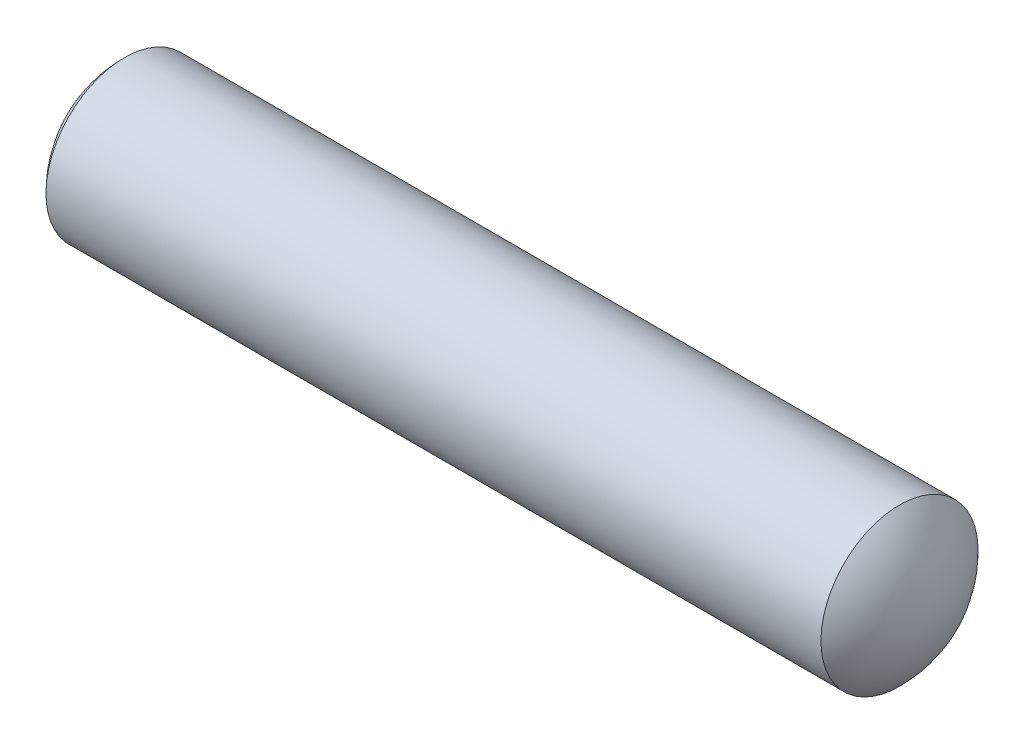
ISO-10303-21;
HEADER;
FILE_DESCRIPTION(('STEP AP214'),'2;1');
FILE_NAME('part.step','',(''),(''),'','','');
FILE_SCHEMA(('AUTOMOTIVE_DESIGN { 1 0 10303 214 1 1 1 1 }'));
ENDSEC;
DATA;
#1=APPLICATION_CONTEXT('core data for automotive mechanical design processes');
#2=APPLICATION_PROTOCOL_DEFINITION('international standard','automotive_design',2000,#1);
#3=PRODUCT_CONTEXT('',#1,'mechanical');
#4=PRODUCT('Part','Part','',(#3));
#5=PRODUCT_RELATED_PRODUCT_CATEGORY('part','',(#4));
#6=PRODUCT_DEFINITION_FORMATION('','',#4);
#7=PRODUCT_DEFINITION_CONTEXT('part definition',#1,'design');
#8=PRODUCT_DEFINITION('design','',#6,#7);
#9=PRODUCT_DEFINITION_SHAPE('','',#8);
#10=(LENGTH_UNIT() NAMED_UNIT(*) SI_UNIT(.MILLI.,.METRE.));
#11=(NAMED_UNIT(*) PLANE_ANGLE_UNIT() SI_UNIT($,.RADIAN.));
#12=(NAMED_UNIT(*) SI_UNIT($,.STERADIAN.) SOLID_ANGLE_UNIT());
#13=UNCERTAINTY_MEASURE_WITH_UNIT(LENGTH_MEASURE(1.E-05),#10,'distance_accuracy_value','');
#14=(GEOMETRIC_REPRESENTATION_CONTEXT(3) GLOBAL_UNCERTAINTY_ASSIGNED_CONTEXT((#13)) GLOBAL_UNIT_ASSIGNED_CONTEXT((#10,
#11,#12)) REPRESENTATION_CONTEXT('',''));
#15=CARTESIAN_POINT('',(0.,0.,0.));
#16=DIRECTION('',(0.,0.,1.));
#17=DIRECTION('',(1.,0.,0.));
#18=AXIS2_PLACEMENT_3D('',#15,#16,#17);
#19=CARTESIAN_POINT('',(15.1875,-3.03308499069939,-21.0955694800874));
#20=DIRECTION('',(0.,0.989821441880933,-0.142314838273284));
#21=DIRECTION('',(1.,0.,0.));
#22=AXIS2_PLACEMENT_3D('',#19,#20,#21);
#23=SPHERICAL_SURFACE('',#22,1.8375);
#24=CARTESIAN_POINT('',(15.1875,-3.03308499069939,-21.0955694800874));
#25=DIRECTION('',(-1.,0.,0.));
#26=DIRECTION('',(0.,0.142314838273285,0.989821441880933));
#27=AXIS2_PLACEMENT_3D('',#24,#25,#26);
#28=SPHERICAL_SURFACE('',#27,1.8375);
#29=CARTESIAN_POINT('',(16.4734821149612,-3.03308499069939,-21.0955694800874));
#30=DIRECTION('',(-1.,0.,0.));
#31=DIRECTION('',(0.,0.142314838273285,0.989821441880933));
#32=AXIS2_PLACEMENT_3D('',#29,#30,#31);
#33=CIRCLE('',#32,1.3125);
#34=CARTESIAN_POINT('',(16.4734821149612,-2.8462967654657,-19.7964288376187));
#35=VERTEX_POINT('',#34);
#36=EDGE_CURVE('E11',#35,#35,#33,.T.);
#37=ORIENTED_EDGE('',*,*,#36,.F.);
#38=EDGE_LOOP('',(#37));
#39=FACE_BOUND('',#38,.T.);
#40=ADVANCED_FACE('F17',(#39),#28,.T.);
#41=CARTESIAN_POINT('',(10.,-3.03308499069939,-21.0955694800874));
#42=DIRECTION('',(-1.,0.,0.));
#43=DIRECTION('',(0.,0.142314838273285,0.989821441880933));
#44=AXIS2_PLACEMENT_3D('',#41,#42,#43);
#45=CYLINDRICAL_SURFACE('',#44,1.3125);
#46=CARTESIAN_POINT('',(3.52651788503884,-3.03308499069939,-21.0955694800874));
#47=DIRECTION('',(-1.,0.,0.));
#48=DIRECTION('',(0.,0.142314838273285,0.989821441880933));
#49=AXIS2_PLACEMENT_3D('',#46,#47,#48);
#50=CIRCLE('',#49,1.3125);
#51=CARTESIAN_POINT('',(3.52651788503884,-2.8462967654657,-19.7964288376187));
#52=VERTEX_POINT('',#51);
#53=EDGE_CURVE('E21',#52,#52,#50,.T.);
#54=ORIENTED_EDGE('',*,*,#53,.F.);
#55=EDGE_LOOP('',(#54));
#56=FACE_BOUND('',#55,.T.);
#57=ORIENTED_EDGE('',*,*,#36,.T.);
#58=EDGE_LOOP('',(#57));
#59=FACE_BOUND('',#58,.T.);
#60=ADVANCED_FACE('F19',(#56,#59),#45,.T.);
#61=CARTESIAN_POINT('',(4.8125,-3.03308499069939,-21.0955694800874));
#62=DIRECTION('',(0.,0.989821441880933,-0.142314838273284));
#63=DIRECTION('',(-1.,0.,0.));
#64=AXIS2_PLACEMENT_3D('',#61,#62,#63);
#65=SPHERICAL_SURFACE('',#64,1.8375);
#66=CARTESIAN_POINT('',(4.8125,-3.03308499069939,-21.0955694800874));
#67=DIRECTION('',(-1.,0.,0.));
#68=DIRECTION('',(0.,0.142314838273285,0.989821441880933));
#69=AXIS2_PLACEMENT_3D('',#66,#67,#68);
#70=SPHERICAL_SURFACE('',#69,1.8375);
#71=ORIENTED_EDGE('',*,*,#53,.T.);
#72=EDGE_LOOP('',(#71));
#73=FACE_BOUND('',#72,.T.);
#74=ADVANCED_FACE('F40',(#73),#70,.T.);
#75=CLOSED_SHELL('',(#40,#60,#74));
#76=MANIFOLD_SOLID_BREP('B1',#75);
#77=ADVANCED_BREP_SHAPE_REPRESENTATION('',(#18,#76),#14);
#78=SHAPE_DEFINITION_REPRESENTATION(#9,#77);
ENDSEC;
END-ISO-10303-21;
